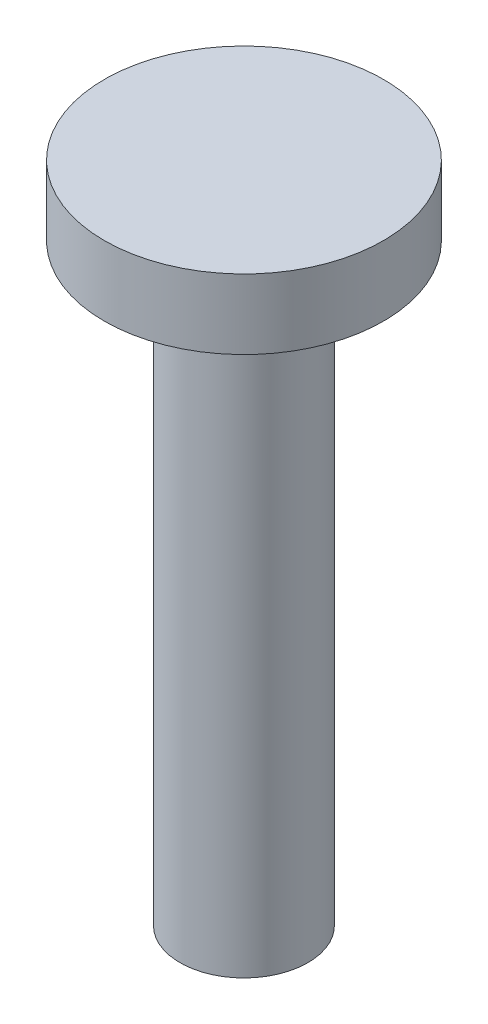
ISO-10303-21;
HEADER;
FILE_DESCRIPTION(('STEP AP214'),'2;1');
FILE_NAME('part.step','',(''),(''),'','','');
FILE_SCHEMA(('AUTOMOTIVE_DESIGN { 1 0 10303 214 1 1 1 1 }'));
ENDSEC;
DATA;
#1=APPLICATION_CONTEXT('core data for automotive mechanical design processes');
#2=APPLICATION_PROTOCOL_DEFINITION('international standard','automotive_design',2000,#1);
#3=PRODUCT_CONTEXT('',#1,'mechanical');
#4=PRODUCT('Part','Part','',(#3));
#5=PRODUCT_RELATED_PRODUCT_CATEGORY('part','',(#4));
#6=PRODUCT_DEFINITION_FORMATION('','',#4);
#7=PRODUCT_DEFINITION_CONTEXT('part definition',#1,'design');
#8=PRODUCT_DEFINITION('design','',#6,#7);
#9=PRODUCT_DEFINITION_SHAPE('','',#8);
#10=(LENGTH_UNIT() NAMED_UNIT(*) SI_UNIT(.MILLI.,.METRE.));
#11=(NAMED_UNIT(*) PLANE_ANGLE_UNIT() SI_UNIT($,.RADIAN.));
#12=(NAMED_UNIT(*) SI_UNIT($,.STERADIAN.) SOLID_ANGLE_UNIT());
#13=UNCERTAINTY_MEASURE_WITH_UNIT(LENGTH_MEASURE(1.E-05),#10,'distance_accuracy_value','');
#14=(GEOMETRIC_REPRESENTATION_CONTEXT(3) GLOBAL_UNCERTAINTY_ASSIGNED_CONTEXT((#13)) GLOBAL_UNIT_ASSIGNED_CONTEXT((#10,
#11,#12)) REPRESENTATION_CONTEXT('',''));
#15=CARTESIAN_POINT('',(0.,0.,0.));
#16=DIRECTION('',(0.,0.,1.));
#17=DIRECTION('',(1.,0.,0.));
#18=AXIS2_PLACEMENT_3D('',#15,#16,#17);
#19=CARTESIAN_POINT('',(0.,58.25,0.));
#20=DIRECTION('',(0.,-1.,0.));
#21=DIRECTION('',(0.,0.,-1.));
#22=AXIS2_PLACEMENT_3D('',#19,#20,#21);
#23=CYLINDRICAL_SURFACE('',#22,6.);
#24=CARTESIAN_POINT('',(0.,58.25,0.));
#25=DIRECTION('',(0.,1.,0.));
#26=DIRECTION('',(0.,0.,1.));
#27=AXIS2_PLACEMENT_3D('',#24,#25,#26);
#28=CIRCLE('',#27,6.);
#29=CARTESIAN_POINT('',(0.,58.25,6.));
#30=VERTEX_POINT('',#29);
#31=EDGE_CURVE('E10',#30,#30,#28,.T.);
#32=ORIENTED_EDGE('',*,*,#31,.F.);
#33=EDGE_LOOP('',(#32));
#34=FACE_BOUND('',#33,.T.);
#35=CARTESIAN_POINT('',(0.,55.25,0.));
#36=DIRECTION('',(0.,1.,0.));
#37=DIRECTION('',(0.,0.,1.));
#38=AXIS2_PLACEMENT_3D('',#35,#36,#37);
#39=CIRCLE('',#38,6.);
#40=CARTESIAN_POINT('',(0.,55.25,6.));
#41=VERTEX_POINT('',#40);
#42=EDGE_CURVE('E36',#41,#41,#39,.T.);
#43=ORIENTED_EDGE('',*,*,#42,.T.);
#44=EDGE_LOOP('',(#43));
#45=FACE_BOUND('',#44,.T.);
#46=ADVANCED_FACE('F32',(#34,#45),#23,.T.);
#47=CARTESIAN_POINT('',(0.,58.25,0.));
#48=DIRECTION('',(0.,1.,0.));
#49=DIRECTION('',(0.,0.,1.));
#50=AXIS2_PLACEMENT_3D('',#47,#48,#49);
#51=PLANE('',#50);
#52=ORIENTED_EDGE('',*,*,#31,.T.);
#53=EDGE_LOOP('',(#52));
#54=FACE_BOUND('',#53,.T.);
#55=ADVANCED_FACE('F60',(#54),#51,.T.);
#56=CARTESIAN_POINT('',(0.,55.25,0.));
#57=DIRECTION('',(0.,1.,0.));
#58=DIRECTION('',(0.,0.,1.));
#59=AXIS2_PLACEMENT_3D('',#56,#57,#58);
#60=PLANE('',#59);
#61=ORIENTED_EDGE('',*,*,#42,.F.);
#62=EDGE_LOOP('',(#61));
#63=FACE_BOUND('',#62,.T.);
#64=CARTESIAN_POINT('',(0.,55.25,0.));
#65=DIRECTION('',(0.,1.,0.));
#66=DIRECTION('',(0.,0.,1.));
#67=AXIS2_PLACEMENT_3D('',#64,#65,#66);
#68=CIRCLE('',#67,2.75);
#69=CARTESIAN_POINT('',(0.,55.25,2.75));
#70=VERTEX_POINT('',#69);
#71=EDGE_CURVE('E43',#70,#70,#68,.F.);
#72=ORIENTED_EDGE('',*,*,#71,.F.);
#73=EDGE_LOOP('',(#72));
#74=FACE_BOUND('',#73,.T.);
#75=ADVANCED_FACE('F55',(#63,#74),#60,.F.);
#76=CARTESIAN_POINT('',(0.,63.7352813742386,0.));
#77=DIRECTION('',(0.,-1.,0.));
#78=DIRECTION('',(0.,0.,-1.));
#79=AXIS2_PLACEMENT_3D('',#76,#77,#78);
#80=CYLINDRICAL_SURFACE('',#79,2.75);
#81=CARTESIAN_POINT('',(0.,29.75,0.));
#82=DIRECTION('',(0.,-1.,0.));
#83=DIRECTION('',(0.,0.,-1.));
#84=AXIS2_PLACEMENT_3D('',#81,#82,#83);
#85=CIRCLE('',#84,2.75);
#86=CARTESIAN_POINT('',(0.,29.75,-2.75));
#87=VERTEX_POINT('',#86);
#88=EDGE_CURVE('E47',#87,#87,#85,.T.);
#89=ORIENTED_EDGE('',*,*,#88,.F.);
#90=EDGE_LOOP('',(#89));
#91=FACE_BOUND('',#90,.T.);
#92=ORIENTED_EDGE('',*,*,#71,.T.);
#93=EDGE_LOOP('',(#92));
#94=FACE_BOUND('',#93,.T.);
#95=ADVANCED_FACE('F52',(#91,#94),#80,.T.);
#96=CARTESIAN_POINT('',(0.,29.75,0.));
#97=DIRECTION('',(0.,1.,0.));
#98=DIRECTION('',(0.,0.,1.));
#99=AXIS2_PLACEMENT_3D('',#96,#97,#98);
#100=PLANE('',#99);
#101=ORIENTED_EDGE('',*,*,#88,.T.);
#102=EDGE_LOOP('',(#101));
#103=FACE_BOUND('',#102,.T.);
#104=ADVANCED_FACE('F34',(#103),#100,.F.);
#105=CLOSED_SHELL('',(#46,#55,#75,#95,#104));
#106=MANIFOLD_SOLID_BREP('B2',#105);
#107=ADVANCED_BREP_SHAPE_REPRESENTATION('',(#18,#106),#14);
#108=SHAPE_DEFINITION_REPRESENTATION(#9,#107);
ENDSEC;
END-ISO-10303-21;
